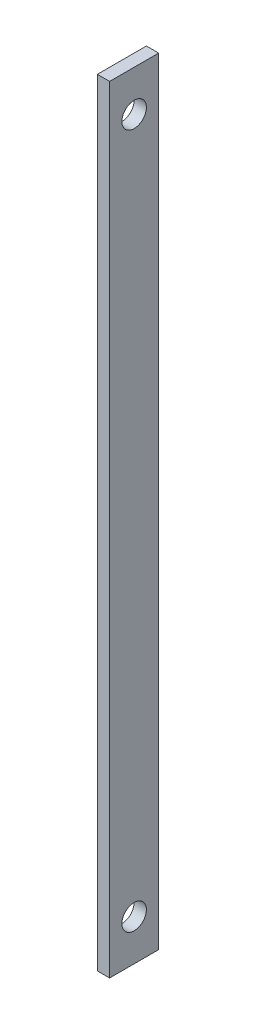
ISO-10303-21;
HEADER;
FILE_DESCRIPTION(('STEP AP214'),'2;1');
FILE_NAME('part.step','',(''),(''),'','','');
FILE_SCHEMA(('AUTOMOTIVE_DESIGN { 1 0 10303 214 1 1 1 1 }'));
ENDSEC;
DATA;
#1=APPLICATION_CONTEXT('core data for automotive mechanical design processes');
#2=APPLICATION_PROTOCOL_DEFINITION('international standard','automotive_design',2000,#1);
#3=PRODUCT_CONTEXT('',#1,'mechanical');
#4=PRODUCT('Part','Part','',(#3));
#5=PRODUCT_RELATED_PRODUCT_CATEGORY('part','',(#4));
#6=PRODUCT_DEFINITION_FORMATION('','',#4);
#7=PRODUCT_DEFINITION_CONTEXT('part definition',#1,'design');
#8=PRODUCT_DEFINITION('design','',#6,#7);
#9=PRODUCT_DEFINITION_SHAPE('','',#8);
#10=(LENGTH_UNIT() NAMED_UNIT(*) SI_UNIT(.MILLI.,.METRE.));
#11=(NAMED_UNIT(*) PLANE_ANGLE_UNIT() SI_UNIT($,.RADIAN.));
#12=(NAMED_UNIT(*) SI_UNIT($,.STERADIAN.) SOLID_ANGLE_UNIT());
#13=UNCERTAINTY_MEASURE_WITH_UNIT(LENGTH_MEASURE(1.E-05),#10,'distance_accuracy_value','');
#14=(GEOMETRIC_REPRESENTATION_CONTEXT(3) GLOBAL_UNCERTAINTY_ASSIGNED_CONTEXT((#13)) GLOBAL_UNIT_ASSIGNED_CONTEXT((#10,
#11,#12)) REPRESENTATION_CONTEXT('',''));
#15=CARTESIAN_POINT('',(0.,0.,0.));
#16=DIRECTION('',(0.,0.,1.));
#17=DIRECTION('',(1.,0.,0.));
#18=AXIS2_PLACEMENT_3D('',#15,#16,#17);
#19=CARTESIAN_POINT('',(3.,-95.,-6.));
#20=DIRECTION('',(0.,0.,1.));
#21=DIRECTION('',(1.,0.,0.));
#22=AXIS2_PLACEMENT_3D('',#19,#20,#21);
#23=PLANE('',#22);
#24=DIRECTION('',(0.,1.,0.));
#25=VECTOR('',#24,1.);
#26=CARTESIAN_POINT('',(0.,-95.,-6.));
#27=LINE('',#26,#25);
#28=CARTESIAN_POINT('',(0.,-95.,-6.));
#29=VERTEX_POINT('',#28);
#30=CARTESIAN_POINT('',(0.,95.,-6.));
#31=VERTEX_POINT('',#30);
#32=EDGE_CURVE('E95',#29,#31,#27,.T.);
#33=ORIENTED_EDGE('',*,*,#32,.T.);
#34=DIRECTION('',(-1.,0.,0.));
#35=VECTOR('',#34,1.);
#36=CARTESIAN_POINT('',(3.,95.,-6.));
#37=LINE('',#36,#35);
#38=CARTESIAN_POINT('',(3.,95.,-6.));
#39=VERTEX_POINT('',#38);
#40=EDGE_CURVE('E11',#39,#31,#37,.T.);
#41=ORIENTED_EDGE('',*,*,#40,.F.);
#42=DIRECTION('',(0.,1.,0.));
#43=VECTOR('',#42,1.);
#44=CARTESIAN_POINT('',(3.,-95.,-6.));
#45=LINE('',#44,#43);
#46=CARTESIAN_POINT('',(3.,-95.,-6.));
#47=VERTEX_POINT('',#46);
#48=EDGE_CURVE('E83',#47,#39,#45,.T.);
#49=ORIENTED_EDGE('',*,*,#48,.F.);
#50=DIRECTION('',(-1.,0.,0.));
#51=VECTOR('',#50,1.);
#52=CARTESIAN_POINT('',(3.,-95.,-6.));
#53=LINE('',#52,#51);
#54=EDGE_CURVE('E91',#47,#29,#53,.T.);
#55=ORIENTED_EDGE('',*,*,#54,.T.);
#56=EDGE_LOOP('',(#33,#41,#49,#55));
#57=FACE_BOUND('',#56,.T.);
#58=ADVANCED_FACE('F32',(#57),#23,.F.);
#59=CARTESIAN_POINT('',(3.,95.,6.));
#60=DIRECTION('',(0.,-1.,0.));
#61=DIRECTION('',(0.,0.,-1.));
#62=AXIS2_PLACEMENT_3D('',#59,#60,#61);
#63=PLANE('',#62);
#64=DIRECTION('',(0.,0.,1.));
#65=VECTOR('',#64,1.);
#66=CARTESIAN_POINT('',(0.,95.,6.));
#67=LINE('',#66,#65);
#68=CARTESIAN_POINT('',(0.,95.,6.));
#69=VERTEX_POINT('',#68);
#70=EDGE_CURVE('E87',#31,#69,#67,.T.);
#71=ORIENTED_EDGE('',*,*,#70,.T.);
#72=DIRECTION('',(-1.,0.,0.));
#73=VECTOR('',#72,1.);
#74=CARTESIAN_POINT('',(3.,95.,6.));
#75=LINE('',#74,#73);
#76=CARTESIAN_POINT('',(3.,95.,6.));
#77=VERTEX_POINT('',#76);
#78=EDGE_CURVE('E40',#77,#69,#75,.T.);
#79=ORIENTED_EDGE('',*,*,#78,.F.);
#80=DIRECTION('',(0.,0.,1.));
#81=VECTOR('',#80,1.);
#82=CARTESIAN_POINT('',(3.,95.,6.));
#83=LINE('',#82,#81);
#84=EDGE_CURVE('E78',#39,#77,#83,.T.);
#85=ORIENTED_EDGE('',*,*,#84,.F.);
#86=ORIENTED_EDGE('',*,*,#40,.T.);
#87=EDGE_LOOP('',(#71,#79,#85,#86));
#88=FACE_BOUND('',#87,.T.);
#89=ADVANCED_FACE('F86',(#88),#63,.F.);
#90=CARTESIAN_POINT('',(3.,-95.,6.));
#91=DIRECTION('',(0.,0.,-1.));
#92=DIRECTION('',(-1.,0.,0.));
#93=AXIS2_PLACEMENT_3D('',#90,#91,#92);
#94=PLANE('',#93);
#95=DIRECTION('',(0.,-1.,0.));
#96=VECTOR('',#95,1.);
#97=CARTESIAN_POINT('',(0.,-95.,6.));
#98=LINE('',#97,#96);
#99=CARTESIAN_POINT('',(0.,-95.,6.));
#100=VERTEX_POINT('',#99);
#101=EDGE_CURVE('E65',#69,#100,#98,.T.);
#102=ORIENTED_EDGE('',*,*,#101,.T.);
#103=DIRECTION('',(-1.,0.,0.));
#104=VECTOR('',#103,1.);
#105=CARTESIAN_POINT('',(3.,-95.,6.));
#106=LINE('',#105,#104);
#107=CARTESIAN_POINT('',(3.,-95.,6.));
#108=VERTEX_POINT('',#107);
#109=EDGE_CURVE('E88',#108,#100,#106,.T.);
#110=ORIENTED_EDGE('',*,*,#109,.F.);
#111=DIRECTION('',(0.,-1.,0.));
#112=VECTOR('',#111,1.);
#113=CARTESIAN_POINT('',(3.,-95.,6.));
#114=LINE('',#113,#112);
#115=EDGE_CURVE('E81',#77,#108,#114,.T.);
#116=ORIENTED_EDGE('',*,*,#115,.F.);
#117=ORIENTED_EDGE('',*,*,#78,.T.);
#118=EDGE_LOOP('',(#102,#110,#116,#117));
#119=FACE_BOUND('',#118,.T.);
#120=ADVANCED_FACE('F89',(#119),#94,.F.);
#121=CARTESIAN_POINT('',(3.,-95.,6.));
#122=DIRECTION('',(0.,1.,0.));
#123=DIRECTION('',(0.,0.,1.));
#124=AXIS2_PLACEMENT_3D('',#121,#122,#123);
#125=PLANE('',#124);
#126=DIRECTION('',(0.,0.,-1.));
#127=VECTOR('',#126,1.);
#128=CARTESIAN_POINT('',(0.,-95.,6.));
#129=LINE('',#128,#127);
#130=EDGE_CURVE('E71',#100,#29,#129,.T.);
#131=ORIENTED_EDGE('',*,*,#130,.T.);
#132=ORIENTED_EDGE('',*,*,#54,.F.);
#133=DIRECTION('',(0.,0.,-1.));
#134=VECTOR('',#133,1.);
#135=CARTESIAN_POINT('',(3.,-95.,6.));
#136=LINE('',#135,#134);
#137=EDGE_CURVE('E48',#108,#47,#136,.T.);
#138=ORIENTED_EDGE('',*,*,#137,.F.);
#139=ORIENTED_EDGE('',*,*,#109,.T.);
#140=EDGE_LOOP('',(#131,#132,#138,#139));
#141=FACE_BOUND('',#140,.T.);
#142=ADVANCED_FACE('F103',(#141),#125,.F.);
#143=CARTESIAN_POINT('',(3.,0.,0.));
#144=DIRECTION('',(-1.,0.,0.));
#145=DIRECTION('',(0.,0.,1.));
#146=AXIS2_PLACEMENT_3D('',#143,#144,#145);
#147=PLANE('',#146);
#148=CARTESIAN_POINT('',(3.,-85.,0.));
#149=DIRECTION('',(-1.,0.,0.));
#150=DIRECTION('',(0.,0.,1.));
#151=AXIS2_PLACEMENT_3D('',#148,#149,#150);
#152=CIRCLE('',#151,3.);
#153=CARTESIAN_POINT('',(3.,-85.,3.));
#154=VERTEX_POINT('',#153);
#155=EDGE_CURVE('E114',#154,#154,#152,.F.);
#156=ORIENTED_EDGE('',*,*,#155,.F.);
#157=EDGE_LOOP('',(#156));
#158=FACE_BOUND('',#157,.T.);
#159=CARTESIAN_POINT('',(3.,85.,0.));
#160=DIRECTION('',(-1.,0.,0.));
#161=DIRECTION('',(0.,0.,1.));
#162=AXIS2_PLACEMENT_3D('',#159,#160,#161);
#163=CIRCLE('',#162,3.);
#164=CARTESIAN_POINT('',(3.,85.,3.));
#165=VERTEX_POINT('',#164);
#166=EDGE_CURVE('E98',#165,#165,#163,.F.);
#167=ORIENTED_EDGE('',*,*,#166,.F.);
#168=EDGE_LOOP('',(#167));
#169=FACE_BOUND('',#168,.T.);
#170=ORIENTED_EDGE('',*,*,#48,.T.);
#171=ORIENTED_EDGE('',*,*,#84,.T.);
#172=ORIENTED_EDGE('',*,*,#115,.T.);
#173=ORIENTED_EDGE('',*,*,#137,.T.);
#174=EDGE_LOOP('',(#170,#171,#172,#173));
#175=FACE_BOUND('',#174,.T.);
#176=ADVANCED_FACE('F79',(#158,#169,#175),#147,.F.);
#177=CARTESIAN_POINT('',(0.,0.,0.));
#178=DIRECTION('',(-1.,0.,0.));
#179=DIRECTION('',(0.,0.,1.));
#180=AXIS2_PLACEMENT_3D('',#177,#178,#179);
#181=PLANE('',#180);
#182=CARTESIAN_POINT('',(0.,-85.,0.));
#183=DIRECTION('',(-1.,0.,0.));
#184=DIRECTION('',(0.,0.,1.));
#185=AXIS2_PLACEMENT_3D('',#182,#183,#184);
#186=CIRCLE('',#185,3.);
#187=CARTESIAN_POINT('',(0.,-85.,3.));
#188=VERTEX_POINT('',#187);
#189=EDGE_CURVE('E117',#188,#188,#186,.T.);
#190=ORIENTED_EDGE('',*,*,#189,.F.);
#191=EDGE_LOOP('',(#190));
#192=FACE_BOUND('',#191,.T.);
#193=CARTESIAN_POINT('',(0.,85.,0.));
#194=DIRECTION('',(-1.,0.,0.));
#195=DIRECTION('',(0.,0.,1.));
#196=AXIS2_PLACEMENT_3D('',#193,#194,#195);
#197=CIRCLE('',#196,3.);
#198=CARTESIAN_POINT('',(0.,85.,3.));
#199=VERTEX_POINT('',#198);
#200=EDGE_CURVE('E111',#199,#199,#197,.T.);
#201=ORIENTED_EDGE('',*,*,#200,.F.);
#202=EDGE_LOOP('',(#201));
#203=FACE_BOUND('',#202,.T.);
#204=ORIENTED_EDGE('',*,*,#32,.F.);
#205=ORIENTED_EDGE('',*,*,#130,.F.);
#206=ORIENTED_EDGE('',*,*,#101,.F.);
#207=ORIENTED_EDGE('',*,*,#70,.F.);
#208=EDGE_LOOP('',(#204,#205,#206,#207));
#209=FACE_BOUND('',#208,.T.);
#210=ADVANCED_FACE('F106',(#192,#203,#209),#181,.T.);
#211=CARTESIAN_POINT('',(11.4852813742386,85.,0.));
#212=DIRECTION('',(-1.,0.,0.));
#213=DIRECTION('',(0.,0.,1.));
#214=AXIS2_PLACEMENT_3D('',#211,#212,#213);
#215=CYLINDRICAL_SURFACE('',#214,3.);
#216=ORIENTED_EDGE('',*,*,#166,.T.);
#217=EDGE_LOOP('',(#216));
#218=FACE_BOUND('',#217,.T.);
#219=ORIENTED_EDGE('',*,*,#200,.T.);
#220=EDGE_LOOP('',(#219));
#221=FACE_BOUND('',#220,.T.);
#222=ADVANCED_FACE('F125',(#218,#221),#215,.F.);
#223=CARTESIAN_POINT('',(11.4852813742386,-85.,0.));
#224=DIRECTION('',(-1.,0.,0.));
#225=DIRECTION('',(0.,0.,1.));
#226=AXIS2_PLACEMENT_3D('',#223,#224,#225);
#227=CYLINDRICAL_SURFACE('',#226,3.);
#228=ORIENTED_EDGE('',*,*,#155,.T.);
#229=EDGE_LOOP('',(#228));
#230=FACE_BOUND('',#229,.T.);
#231=ORIENTED_EDGE('',*,*,#189,.T.);
#232=EDGE_LOOP('',(#231));
#233=FACE_BOUND('',#232,.T.);
#234=ADVANCED_FACE('F121',(#230,#233),#227,.F.);
#235=CLOSED_SHELL('',(#58,#89,#120,#142,#176,#210,#222,#234));
#236=MANIFOLD_SOLID_BREP('B2',#235);
#237=ADVANCED_BREP_SHAPE_REPRESENTATION('',(#18,#236),#14);
#238=SHAPE_DEFINITION_REPRESENTATION(#9,#237);
ENDSEC;
END-ISO-10303-21;
